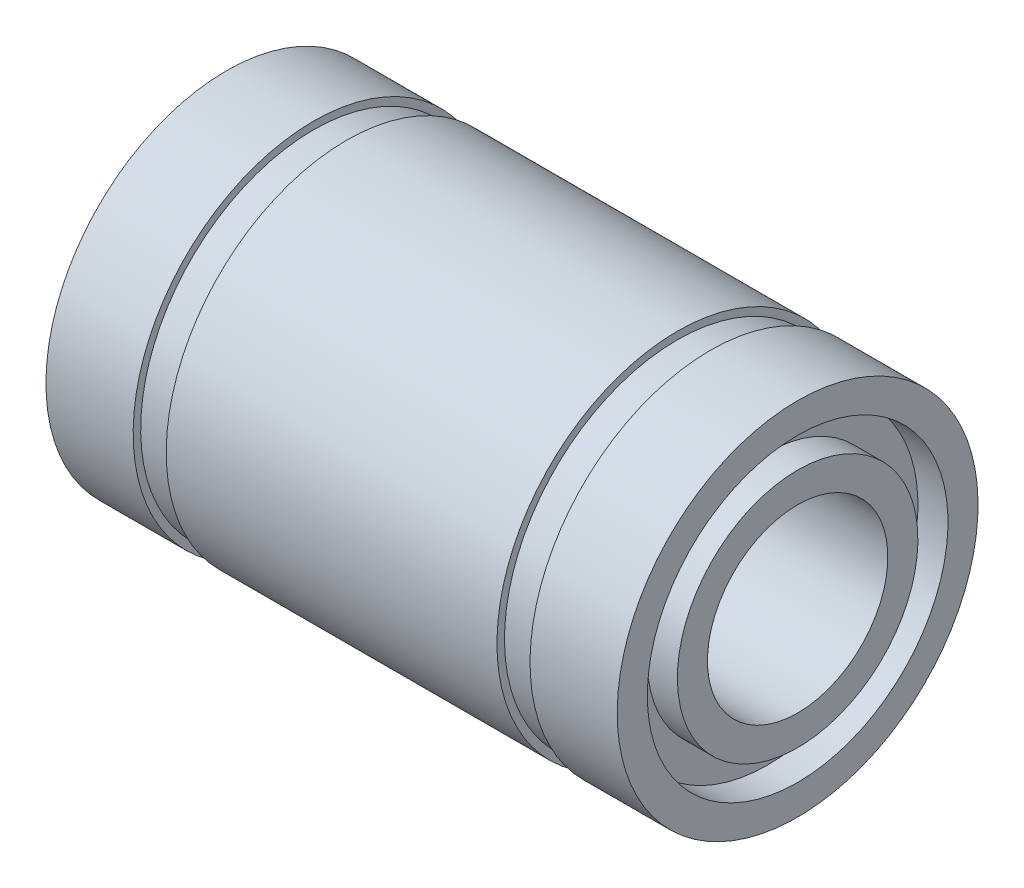
ISO-10303-21;
HEADER;
FILE_DESCRIPTION(('STEP AP214'),'2;1');
FILE_NAME('part.step','',(''),(''),'','','');
FILE_SCHEMA(('AUTOMOTIVE_DESIGN { 1 0 10303 214 1 1 1 1 }'));
ENDSEC;
DATA;
#1=APPLICATION_CONTEXT('core data for automotive mechanical design processes');
#2=APPLICATION_PROTOCOL_DEFINITION('international standard','automotive_design',2000,#1);
#3=PRODUCT_CONTEXT('',#1,'mechanical');
#4=PRODUCT('Part','Part','',(#3));
#5=PRODUCT_RELATED_PRODUCT_CATEGORY('part','',(#4));
#6=PRODUCT_DEFINITION_FORMATION('','',#4);
#7=PRODUCT_DEFINITION_CONTEXT('part definition',#1,'design');
#8=PRODUCT_DEFINITION('design','',#6,#7);
#9=PRODUCT_DEFINITION_SHAPE('','',#8);
#10=(LENGTH_UNIT() NAMED_UNIT(*) SI_UNIT(.MILLI.,.METRE.));
#11=(NAMED_UNIT(*) PLANE_ANGLE_UNIT() SI_UNIT($,.RADIAN.));
#12=(NAMED_UNIT(*) SI_UNIT($,.STERADIAN.) SOLID_ANGLE_UNIT());
#13=UNCERTAINTY_MEASURE_WITH_UNIT(LENGTH_MEASURE(1.E-05),#10,'distance_accuracy_value','');
#14=(GEOMETRIC_REPRESENTATION_CONTEXT(3) GLOBAL_UNCERTAINTY_ASSIGNED_CONTEXT((#13)) GLOBAL_UNIT_ASSIGNED_CONTEXT((#10,
#11,#12)) REPRESENTATION_CONTEXT('',''));
#15=CARTESIAN_POINT('',(0.,0.,0.));
#16=DIRECTION('',(0.,0.,1.));
#17=DIRECTION('',(1.,0.,0.));
#18=AXIS2_PLACEMENT_3D('',#15,#16,#17);
#19=CARTESIAN_POINT('',(-9.5,5.,0.));
#20=DIRECTION('',(-1.,0.,0.));
#21=DIRECTION('',(0.,-1.,0.));
#22=AXIS2_PLACEMENT_3D('',#19,#20,#21);
#23=PLANE('',#22);
#24=CARTESIAN_POINT('',(-9.5,0.,0.));
#25=DIRECTION('',(1.,0.,0.));
#26=DIRECTION('',(0.,1.,0.));
#27=AXIS2_PLACEMENT_3D('',#24,#25,#26);
#28=CIRCLE('',#27,5.);
#29=CARTESIAN_POINT('',(-9.5,5.,0.));
#30=VERTEX_POINT('',#29);
#31=EDGE_CURVE('E121',#30,#30,#28,.T.);
#32=ORIENTED_EDGE('',*,*,#31,.T.);
#33=EDGE_LOOP('',(#32));
#34=FACE_BOUND('',#33,.T.);
#35=CARTESIAN_POINT('',(-9.5,0.,0.));
#36=DIRECTION('',(1.,0.,0.));
#37=DIRECTION('',(0.,1.,0.));
#38=AXIS2_PLACEMENT_3D('',#35,#36,#37);
#39=CIRCLE('',#38,6.);
#40=CARTESIAN_POINT('',(-9.5,6.,0.));
#41=VERTEX_POINT('',#40);
#42=EDGE_CURVE('E10',#41,#41,#39,.T.);
#43=ORIENTED_EDGE('',*,*,#42,.F.);
#44=EDGE_LOOP('',(#43));
#45=FACE_BOUND('',#44,.T.);
#46=ADVANCED_FACE('F38',(#34,#45),#23,.T.);
#47=CARTESIAN_POINT('',(0.,0.,0.));
#48=DIRECTION('',(1.,0.,0.));
#49=DIRECTION('',(0.,1.,0.));
#50=AXIS2_PLACEMENT_3D('',#47,#48,#49);
#51=CYLINDRICAL_SURFACE('',#50,6.);
#52=ORIENTED_EDGE('',*,*,#42,.T.);
#53=EDGE_LOOP('',(#52));
#54=FACE_BOUND('',#53,.T.);
#55=CARTESIAN_POINT('',(-6.6,0.,0.));
#56=DIRECTION('',(1.,0.,0.));
#57=DIRECTION('',(0.,1.,0.));
#58=AXIS2_PLACEMENT_3D('',#55,#56,#57);
#59=CIRCLE('',#58,6.);
#60=CARTESIAN_POINT('',(-6.6,6.,0.));
#61=VERTEX_POINT('',#60);
#62=EDGE_CURVE('E45',#61,#61,#59,.T.);
#63=ORIENTED_EDGE('',*,*,#62,.F.);
#64=EDGE_LOOP('',(#63));
#65=FACE_BOUND('',#64,.T.);
#66=ADVANCED_FACE('F140',(#54,#65),#51,.T.);
#67=CARTESIAN_POINT('',(-6.6,6.,0.));
#68=DIRECTION('',(1.,0.,0.));
#69=DIRECTION('',(0.,1.,0.));
#70=AXIS2_PLACEMENT_3D('',#67,#68,#69);
#71=PLANE('',#70);
#72=ORIENTED_EDGE('',*,*,#62,.T.);
#73=EDGE_LOOP('',(#72));
#74=FACE_BOUND('',#73,.T.);
#75=CARTESIAN_POINT('',(-6.6,0.,0.));
#76=DIRECTION('',(1.,0.,0.));
#77=DIRECTION('',(0.,1.,0.));
#78=AXIS2_PLACEMENT_3D('',#75,#76,#77);
#79=CIRCLE('',#78,5.75);
#80=CARTESIAN_POINT('',(-6.6,5.75,0.));
#81=VERTEX_POINT('',#80);
#82=EDGE_CURVE('E52',#81,#81,#79,.T.);
#83=ORIENTED_EDGE('',*,*,#82,.F.);
#84=EDGE_LOOP('',(#83));
#85=FACE_BOUND('',#84,.T.);
#86=ADVANCED_FACE('F144',(#74,#85),#71,.T.);
#87=CARTESIAN_POINT('',(0.,0.,0.));
#88=DIRECTION('',(1.,0.,0.));
#89=DIRECTION('',(0.,1.,0.));
#90=AXIS2_PLACEMENT_3D('',#87,#88,#89);
#91=CYLINDRICAL_SURFACE('',#90,5.75);
#92=ORIENTED_EDGE('',*,*,#82,.T.);
#93=EDGE_LOOP('',(#92));
#94=FACE_BOUND('',#93,.T.);
#95=CARTESIAN_POINT('',(-5.5,0.,0.));
#96=DIRECTION('',(1.,0.,0.));
#97=DIRECTION('',(0.,1.,0.));
#98=AXIS2_PLACEMENT_3D('',#95,#96,#97);
#99=CIRCLE('',#98,5.75);
#100=CARTESIAN_POINT('',(-5.5,5.75,0.));
#101=VERTEX_POINT('',#100);
#102=EDGE_CURVE('E58',#101,#101,#99,.T.);
#103=ORIENTED_EDGE('',*,*,#102,.F.);
#104=EDGE_LOOP('',(#103));
#105=FACE_BOUND('',#104,.T.);
#106=ADVANCED_FACE('F148',(#94,#105),#91,.T.);
#107=CARTESIAN_POINT('',(-5.5,5.75,0.));
#108=DIRECTION('',(-1.,0.,0.));
#109=DIRECTION('',(0.,-1.,0.));
#110=AXIS2_PLACEMENT_3D('',#107,#108,#109);
#111=PLANE('',#110);
#112=ORIENTED_EDGE('',*,*,#102,.T.);
#113=EDGE_LOOP('',(#112));
#114=FACE_BOUND('',#113,.T.);
#115=CARTESIAN_POINT('',(-5.5,0.,0.));
#116=DIRECTION('',(1.,0.,0.));
#117=DIRECTION('',(0.,1.,0.));
#118=AXIS2_PLACEMENT_3D('',#115,#116,#117);
#119=CIRCLE('',#118,6.);
#120=CARTESIAN_POINT('',(-5.5,6.,0.));
#121=VERTEX_POINT('',#120);
#122=EDGE_CURVE('E64',#121,#121,#119,.T.);
#123=ORIENTED_EDGE('',*,*,#122,.F.);
#124=EDGE_LOOP('',(#123));
#125=FACE_BOUND('',#124,.T.);
#126=ADVANCED_FACE('F154',(#114,#125),#111,.T.);
#127=CARTESIAN_POINT('',(0.,0.,0.));
#128=DIRECTION('',(1.,0.,0.));
#129=DIRECTION('',(0.,1.,0.));
#130=AXIS2_PLACEMENT_3D('',#127,#128,#129);
#131=CYLINDRICAL_SURFACE('',#130,6.);
#132=ORIENTED_EDGE('',*,*,#122,.T.);
#133=EDGE_LOOP('',(#132));
#134=FACE_BOUND('',#133,.T.);
#135=CARTESIAN_POINT('',(5.5,0.,0.));
#136=DIRECTION('',(1.,0.,0.));
#137=DIRECTION('',(0.,1.,0.));
#138=AXIS2_PLACEMENT_3D('',#135,#136,#137);
#139=CIRCLE('',#138,6.);
#140=CARTESIAN_POINT('',(5.5,6.,0.));
#141=VERTEX_POINT('',#140);
#142=EDGE_CURVE('E68',#141,#141,#139,.T.);
#143=ORIENTED_EDGE('',*,*,#142,.F.);
#144=EDGE_LOOP('',(#143));
#145=FACE_BOUND('',#144,.T.);
#146=ADVANCED_FACE('F158',(#134,#145),#131,.T.);
#147=CARTESIAN_POINT('',(5.5,6.,0.));
#148=DIRECTION('',(1.,0.,0.));
#149=DIRECTION('',(0.,1.,0.));
#150=AXIS2_PLACEMENT_3D('',#147,#148,#149);
#151=PLANE('',#150);
#152=ORIENTED_EDGE('',*,*,#142,.T.);
#153=EDGE_LOOP('',(#152));
#154=FACE_BOUND('',#153,.T.);
#155=CARTESIAN_POINT('',(5.5,0.,0.));
#156=DIRECTION('',(1.,0.,0.));
#157=DIRECTION('',(0.,1.,0.));
#158=AXIS2_PLACEMENT_3D('',#155,#156,#157);
#159=CIRCLE('',#158,5.75);
#160=CARTESIAN_POINT('',(5.5,5.75,0.));
#161=VERTEX_POINT('',#160);
#162=EDGE_CURVE('E72',#161,#161,#159,.T.);
#163=ORIENTED_EDGE('',*,*,#162,.F.);
#164=EDGE_LOOP('',(#163));
#165=FACE_BOUND('',#164,.T.);
#166=ADVANCED_FACE('F162',(#154,#165),#151,.T.);
#167=CARTESIAN_POINT('',(0.,0.,0.));
#168=DIRECTION('',(1.,0.,0.));
#169=DIRECTION('',(0.,1.,0.));
#170=AXIS2_PLACEMENT_3D('',#167,#168,#169);
#171=CYLINDRICAL_SURFACE('',#170,5.75);
#172=ORIENTED_EDGE('',*,*,#162,.T.);
#173=EDGE_LOOP('',(#172));
#174=FACE_BOUND('',#173,.T.);
#175=CARTESIAN_POINT('',(6.6,0.,0.));
#176=DIRECTION('',(1.,0.,0.));
#177=DIRECTION('',(0.,1.,0.));
#178=AXIS2_PLACEMENT_3D('',#175,#176,#177);
#179=CIRCLE('',#178,5.75);
#180=CARTESIAN_POINT('',(6.6,5.75,0.));
#181=VERTEX_POINT('',#180);
#182=EDGE_CURVE('E75',#181,#181,#179,.T.);
#183=ORIENTED_EDGE('',*,*,#182,.F.);
#184=EDGE_LOOP('',(#183));
#185=FACE_BOUND('',#184,.T.);
#186=ADVANCED_FACE('F166',(#174,#185),#171,.T.);
#187=CARTESIAN_POINT('',(6.6,5.75,0.));
#188=DIRECTION('',(-1.,0.,0.));
#189=DIRECTION('',(0.,-1.,0.));
#190=AXIS2_PLACEMENT_3D('',#187,#188,#189);
#191=PLANE('',#190);
#192=ORIENTED_EDGE('',*,*,#182,.T.);
#193=EDGE_LOOP('',(#192));
#194=FACE_BOUND('',#193,.T.);
#195=CARTESIAN_POINT('',(6.6,0.,0.));
#196=DIRECTION('',(1.,0.,0.));
#197=DIRECTION('',(0.,1.,0.));
#198=AXIS2_PLACEMENT_3D('',#195,#196,#197);
#199=CIRCLE('',#198,6.);
#200=CARTESIAN_POINT('',(6.6,6.,0.));
#201=VERTEX_POINT('',#200);
#202=EDGE_CURVE('E79',#201,#201,#199,.T.);
#203=ORIENTED_EDGE('',*,*,#202,.F.);
#204=EDGE_LOOP('',(#203));
#205=FACE_BOUND('',#204,.T.);
#206=ADVANCED_FACE('F170',(#194,#205),#191,.T.);
#207=CARTESIAN_POINT('',(0.,0.,0.));
#208=DIRECTION('',(1.,0.,0.));
#209=DIRECTION('',(0.,1.,0.));
#210=AXIS2_PLACEMENT_3D('',#207,#208,#209);
#211=CYLINDRICAL_SURFACE('',#210,6.00000000000001);
#212=ORIENTED_EDGE('',*,*,#202,.T.);
#213=EDGE_LOOP('',(#212));
#214=FACE_BOUND('',#213,.T.);
#215=CARTESIAN_POINT('',(9.5,0.,0.));
#216=DIRECTION('',(1.,0.,0.));
#217=DIRECTION('',(0.,1.,0.));
#218=AXIS2_PLACEMENT_3D('',#215,#216,#217);
#219=CIRCLE('',#218,6.00000000000001);
#220=CARTESIAN_POINT('',(9.5,6.00000000000001,0.));
#221=VERTEX_POINT('',#220);
#222=EDGE_CURVE('E83',#221,#221,#219,.T.);
#223=ORIENTED_EDGE('',*,*,#222,.F.);
#224=EDGE_LOOP('',(#223));
#225=FACE_BOUND('',#224,.T.);
#226=ADVANCED_FACE('F174',(#214,#225),#211,.T.);
#227=CARTESIAN_POINT('',(9.5,6.00000000000001,0.));
#228=DIRECTION('',(1.,0.,0.));
#229=DIRECTION('',(0.,1.,0.));
#230=AXIS2_PLACEMENT_3D('',#227,#228,#229);
#231=PLANE('',#230);
#232=ORIENTED_EDGE('',*,*,#222,.T.);
#233=EDGE_LOOP('',(#232));
#234=FACE_BOUND('',#233,.T.);
#235=CARTESIAN_POINT('',(9.5,0.,0.));
#236=DIRECTION('',(1.,0.,0.));
#237=DIRECTION('',(0.,1.,0.));
#238=AXIS2_PLACEMENT_3D('',#235,#236,#237);
#239=CIRCLE('',#238,5.);
#240=CARTESIAN_POINT('',(9.5,5.,0.));
#241=VERTEX_POINT('',#240);
#242=EDGE_CURVE('E86',#241,#241,#239,.T.);
#243=ORIENTED_EDGE('',*,*,#242,.F.);
#244=EDGE_LOOP('',(#243));
#245=FACE_BOUND('',#244,.T.);
#246=ADVANCED_FACE('F178',(#234,#245),#231,.T.);
#247=CARTESIAN_POINT('',(0.,0.,0.));
#248=DIRECTION('',(1.,0.,0.));
#249=DIRECTION('',(0.,1.,0.));
#250=AXIS2_PLACEMENT_3D('',#247,#248,#249);
#251=CYLINDRICAL_SURFACE('',#250,5.);
#252=ORIENTED_EDGE('',*,*,#242,.T.);
#253=EDGE_LOOP('',(#252));
#254=FACE_BOUND('',#253,.T.);
#255=CARTESIAN_POINT('',(8.5,0.,0.));
#256=DIRECTION('',(1.,0.,0.));
#257=DIRECTION('',(0.,1.,0.));
#258=AXIS2_PLACEMENT_3D('',#255,#256,#257);
#259=CIRCLE('',#258,5.);
#260=CARTESIAN_POINT('',(8.5,5.,0.));
#261=VERTEX_POINT('',#260);
#262=EDGE_CURVE('E90',#261,#261,#259,.T.);
#263=ORIENTED_EDGE('',*,*,#262,.F.);
#264=EDGE_LOOP('',(#263));
#265=FACE_BOUND('',#264,.T.);
#266=ADVANCED_FACE('F182',(#254,#265),#251,.F.);
#267=CARTESIAN_POINT('',(8.5,5.,0.));
#268=DIRECTION('',(1.,0.,0.));
#269=DIRECTION('',(0.,1.,0.));
#270=AXIS2_PLACEMENT_3D('',#267,#268,#269);
#271=PLANE('',#270);
#272=ORIENTED_EDGE('',*,*,#262,.T.);
#273=EDGE_LOOP('',(#272));
#274=FACE_BOUND('',#273,.T.);
#275=CARTESIAN_POINT('',(8.5,0.,0.));
#276=DIRECTION('',(1.,0.,0.));
#277=DIRECTION('',(0.,1.,0.));
#278=AXIS2_PLACEMENT_3D('',#275,#276,#277);
#279=CIRCLE('',#278,4.);
#280=CARTESIAN_POINT('',(8.5,4.00000000000001,0.));
#281=VERTEX_POINT('',#280);
#282=EDGE_CURVE('E94',#281,#281,#279,.T.);
#283=ORIENTED_EDGE('',*,*,#282,.F.);
#284=EDGE_LOOP('',(#283));
#285=FACE_BOUND('',#284,.T.);
#286=ADVANCED_FACE('F186',(#274,#285),#271,.T.);
#287=CARTESIAN_POINT('',(0.,0.,0.));
#288=DIRECTION('',(1.,0.,0.));
#289=DIRECTION('',(0.,1.,0.));
#290=AXIS2_PLACEMENT_3D('',#287,#288,#289);
#291=CYLINDRICAL_SURFACE('',#290,4.);
#292=ORIENTED_EDGE('',*,*,#282,.T.);
#293=EDGE_LOOP('',(#292));
#294=FACE_BOUND('',#293,.T.);
#295=CARTESIAN_POINT('',(9.5,0.,0.));
#296=DIRECTION('',(1.,0.,0.));
#297=DIRECTION('',(0.,1.,0.));
#298=AXIS2_PLACEMENT_3D('',#295,#296,#297);
#299=CIRCLE('',#298,4.);
#300=CARTESIAN_POINT('',(9.5,4.00000000000001,0.));
#301=VERTEX_POINT('',#300);
#302=EDGE_CURVE('E98',#301,#301,#299,.T.);
#303=ORIENTED_EDGE('',*,*,#302,.F.);
#304=EDGE_LOOP('',(#303));
#305=FACE_BOUND('',#304,.T.);
#306=ADVANCED_FACE('F190',(#294,#305),#291,.T.);
#307=CARTESIAN_POINT('',(9.50000000000001,4.00000000000001,0.));
#308=DIRECTION('',(1.,0.,0.));
#309=DIRECTION('',(0.,1.,0.));
#310=AXIS2_PLACEMENT_3D('',#307,#308,#309);
#311=PLANE('',#310);
#312=ORIENTED_EDGE('',*,*,#302,.T.);
#313=EDGE_LOOP('',(#312));
#314=FACE_BOUND('',#313,.T.);
#315=CARTESIAN_POINT('',(9.50000000000001,0.,0.));
#316=DIRECTION('',(1.,0.,0.));
#317=DIRECTION('',(0.,1.,0.));
#318=AXIS2_PLACEMENT_3D('',#315,#316,#317);
#319=CIRCLE('',#318,3.);
#320=CARTESIAN_POINT('',(9.50000000000001,3.,0.));
#321=VERTEX_POINT('',#320);
#322=EDGE_CURVE('E102',#321,#321,#319,.T.);
#323=ORIENTED_EDGE('',*,*,#322,.F.);
#324=EDGE_LOOP('',(#323));
#325=FACE_BOUND('',#324,.T.);
#326=ADVANCED_FACE('F194',(#314,#325),#311,.T.);
#327=CARTESIAN_POINT('',(0.,0.,0.));
#328=DIRECTION('',(1.,0.,0.));
#329=DIRECTION('',(0.,1.,0.));
#330=AXIS2_PLACEMENT_3D('',#327,#328,#329);
#331=CYLINDRICAL_SURFACE('',#330,3.);
#332=ORIENTED_EDGE('',*,*,#322,.T.);
#333=EDGE_LOOP('',(#332));
#334=FACE_BOUND('',#333,.T.);
#335=CARTESIAN_POINT('',(-9.5,0.,0.));
#336=DIRECTION('',(1.,0.,0.));
#337=DIRECTION('',(0.,1.,0.));
#338=AXIS2_PLACEMENT_3D('',#335,#336,#337);
#339=CIRCLE('',#338,3.);
#340=CARTESIAN_POINT('',(-9.5,3.,0.));
#341=VERTEX_POINT('',#340);
#342=EDGE_CURVE('E106',#341,#341,#339,.T.);
#343=ORIENTED_EDGE('',*,*,#342,.F.);
#344=EDGE_LOOP('',(#343));
#345=FACE_BOUND('',#344,.T.);
#346=ADVANCED_FACE('F198',(#334,#345),#331,.F.);
#347=CARTESIAN_POINT('',(-9.5,3.,0.));
#348=DIRECTION('',(-1.,0.,0.));
#349=DIRECTION('',(0.,-1.,0.));
#350=AXIS2_PLACEMENT_3D('',#347,#348,#349);
#351=PLANE('',#350);
#352=ORIENTED_EDGE('',*,*,#342,.T.);
#353=EDGE_LOOP('',(#352));
#354=FACE_BOUND('',#353,.T.);
#355=CARTESIAN_POINT('',(-9.5,0.,0.));
#356=DIRECTION('',(1.,0.,0.));
#357=DIRECTION('',(0.,1.,0.));
#358=AXIS2_PLACEMENT_3D('',#355,#356,#357);
#359=CIRCLE('',#358,4.);
#360=CARTESIAN_POINT('',(-9.5,4.,0.));
#361=VERTEX_POINT('',#360);
#362=EDGE_CURVE('E110',#361,#361,#359,.T.);
#363=ORIENTED_EDGE('',*,*,#362,.F.);
#364=EDGE_LOOP('',(#363));
#365=FACE_BOUND('',#364,.T.);
#366=ADVANCED_FACE('F202',(#354,#365),#351,.T.);
#367=CARTESIAN_POINT('',(0.,0.,0.));
#368=DIRECTION('',(1.,0.,0.));
#369=DIRECTION('',(0.,1.,0.));
#370=AXIS2_PLACEMENT_3D('',#367,#368,#369);
#371=CYLINDRICAL_SURFACE('',#370,4.);
#372=ORIENTED_EDGE('',*,*,#362,.T.);
#373=EDGE_LOOP('',(#372));
#374=FACE_BOUND('',#373,.T.);
#375=CARTESIAN_POINT('',(-8.5,0.,0.));
#376=DIRECTION('',(1.,0.,0.));
#377=DIRECTION('',(0.,1.,0.));
#378=AXIS2_PLACEMENT_3D('',#375,#376,#377);
#379=CIRCLE('',#378,4.);
#380=CARTESIAN_POINT('',(-8.5,4.,0.));
#381=VERTEX_POINT('',#380);
#382=EDGE_CURVE('E114',#381,#381,#379,.T.);
#383=ORIENTED_EDGE('',*,*,#382,.F.);
#384=EDGE_LOOP('',(#383));
#385=FACE_BOUND('',#384,.T.);
#386=ADVANCED_FACE('F136',(#374,#385),#371,.T.);
#387=CARTESIAN_POINT('',(-8.5,5.,0.));
#388=DIRECTION('',(-1.,0.,0.));
#389=DIRECTION('',(0.,-1.,0.));
#390=AXIS2_PLACEMENT_3D('',#387,#388,#389);
#391=PLANE('',#390);
#392=ORIENTED_EDGE('',*,*,#382,.T.);
#393=EDGE_LOOP('',(#392));
#394=FACE_BOUND('',#393,.T.);
#395=CARTESIAN_POINT('',(-8.5,0.,0.));
#396=DIRECTION('',(1.,0.,0.));
#397=DIRECTION('',(0.,1.,0.));
#398=AXIS2_PLACEMENT_3D('',#395,#396,#397);
#399=CIRCLE('',#398,5.);
#400=CARTESIAN_POINT('',(-8.5,5.,0.));
#401=VERTEX_POINT('',#400);
#402=EDGE_CURVE('E118',#401,#401,#399,.T.);
#403=ORIENTED_EDGE('',*,*,#402,.F.);
#404=EDGE_LOOP('',(#403));
#405=FACE_BOUND('',#404,.T.);
#406=ADVANCED_FACE('F130',(#394,#405),#391,.T.);
#407=CARTESIAN_POINT('',(0.,0.,0.));
#408=DIRECTION('',(1.,0.,0.));
#409=DIRECTION('',(0.,1.,0.));
#410=AXIS2_PLACEMENT_3D('',#407,#408,#409);
#411=CYLINDRICAL_SURFACE('',#410,5.);
#412=ORIENTED_EDGE('',*,*,#402,.T.);
#413=EDGE_LOOP('',(#412));
#414=FACE_BOUND('',#413,.T.);
#415=ORIENTED_EDGE('',*,*,#31,.F.);
#416=EDGE_LOOP('',(#415));
#417=FACE_BOUND('',#416,.T.);
#418=ADVANCED_FACE('F128',(#414,#417),#411,.F.);
#419=CLOSED_SHELL('',(#46,#66,#86,#106,#126,#146,#166,#186,#206,#226,#246,#266,#286,#306,#326,
#346,#366,#386,#406,#418));
#420=MANIFOLD_SOLID_BREP('B2',#419);
#421=ADVANCED_BREP_SHAPE_REPRESENTATION('',(#18,#420),#14);
#422=SHAPE_DEFINITION_REPRESENTATION(#9,#421);
ENDSEC;
END-ISO-10303-21;
